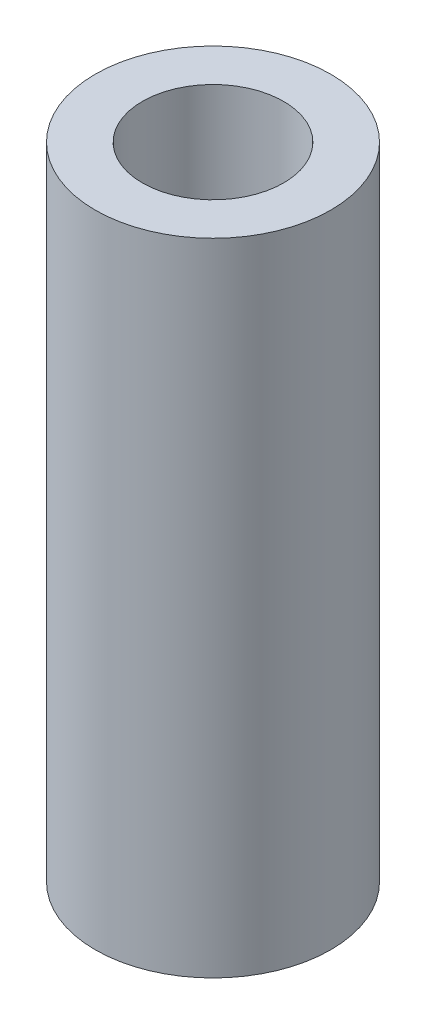
ISO-10303-21;
HEADER;
FILE_DESCRIPTION(('STEP AP214'),'2;1');
FILE_NAME('part.step','',(''),(''),'','','');
FILE_SCHEMA(('AUTOMOTIVE_DESIGN { 1 0 10303 214 1 1 1 1 }'));
ENDSEC;
DATA;
#1=APPLICATION_CONTEXT('core data for automotive mechanical design processes');
#2=APPLICATION_PROTOCOL_DEFINITION('international standard','automotive_design',2000,#1);
#3=PRODUCT_CONTEXT('',#1,'mechanical');
#4=PRODUCT('Part','Part','',(#3));
#5=PRODUCT_RELATED_PRODUCT_CATEGORY('part','',(#4));
#6=PRODUCT_DEFINITION_FORMATION('','',#4);
#7=PRODUCT_DEFINITION_CONTEXT('part definition',#1,'design');
#8=PRODUCT_DEFINITION('design','',#6,#7);
#9=PRODUCT_DEFINITION_SHAPE('','',#8);
#10=(LENGTH_UNIT() NAMED_UNIT(*) SI_UNIT(.MILLI.,.METRE.));
#11=(NAMED_UNIT(*) PLANE_ANGLE_UNIT() SI_UNIT($,.RADIAN.));
#12=(NAMED_UNIT(*) SI_UNIT($,.STERADIAN.) SOLID_ANGLE_UNIT());
#13=UNCERTAINTY_MEASURE_WITH_UNIT(LENGTH_MEASURE(1.E-05),#10,'distance_accuracy_value','');
#14=(GEOMETRIC_REPRESENTATION_CONTEXT(3) GLOBAL_UNCERTAINTY_ASSIGNED_CONTEXT((#13)) GLOBAL_UNIT_ASSIGNED_CONTEXT((#10,
#11,#12)) REPRESENTATION_CONTEXT('',''));
#15=CARTESIAN_POINT('',(0.,0.,0.));
#16=DIRECTION('',(0.,0.,1.));
#17=DIRECTION('',(1.,0.,0.));
#18=AXIS2_PLACEMENT_3D('',#15,#16,#17);
#19=CARTESIAN_POINT('',(0.,34.544,0.));
#20=DIRECTION('',(0.,1.,0.));
#21=DIRECTION('',(0.,0.,1.));
#22=AXIS2_PLACEMENT_3D('',#19,#20,#21);
#23=PLANE('',#22);
#24=CARTESIAN_POINT('',(0.,34.544,0.));
#25=DIRECTION('',(0.,1.,0.));
#26=DIRECTION('',(0.,0.,1.));
#27=AXIS2_PLACEMENT_3D('',#24,#25,#26);
#28=CIRCLE('',#27,6.35);
#29=CARTESIAN_POINT('',(0.,34.544,6.35));
#30=VERTEX_POINT('',#29);
#31=EDGE_CURVE('E10',#30,#30,#28,.T.);
#32=ORIENTED_EDGE('',*,*,#31,.T.);
#33=EDGE_LOOP('',(#32));
#34=FACE_BOUND('',#33,.T.);
#35=CARTESIAN_POINT('',(0.,34.544,0.));
#36=DIRECTION('',(0.,1.,0.));
#37=DIRECTION('',(0.,0.,1.));
#38=AXIS2_PLACEMENT_3D('',#35,#36,#37);
#39=CIRCLE('',#38,3.81);
#40=CARTESIAN_POINT('',(0.,34.544,3.81));
#41=VERTEX_POINT('',#40);
#42=EDGE_CURVE('E56',#41,#41,#39,.T.);
#43=ORIENTED_EDGE('',*,*,#42,.F.);
#44=EDGE_LOOP('',(#43));
#45=FACE_BOUND('',#44,.T.);
#46=ADVANCED_FACE('F43',(#34,#45),#23,.T.);
#47=CARTESIAN_POINT('',(0.,0.,0.));
#48=DIRECTION('',(0.,1.,0.));
#49=DIRECTION('',(0.,0.,1.));
#50=AXIS2_PLACEMENT_3D('',#47,#48,#49);
#51=PLANE('',#50);
#52=CARTESIAN_POINT('',(0.,0.,0.));
#53=DIRECTION('',(0.,1.,0.));
#54=DIRECTION('',(0.,0.,1.));
#55=AXIS2_PLACEMENT_3D('',#52,#53,#54);
#56=CIRCLE('',#55,6.35);
#57=CARTESIAN_POINT('',(0.,0.,6.35));
#58=VERTEX_POINT('',#57);
#59=EDGE_CURVE('E47',#58,#58,#56,.T.);
#60=ORIENTED_EDGE('',*,*,#59,.F.);
#61=EDGE_LOOP('',(#60));
#62=FACE_BOUND('',#61,.T.);
#63=CARTESIAN_POINT('',(0.,0.,0.));
#64=DIRECTION('',(0.,1.,0.));
#65=DIRECTION('',(0.,0.,1.));
#66=AXIS2_PLACEMENT_3D('',#63,#64,#65);
#67=CIRCLE('',#66,3.81);
#68=CARTESIAN_POINT('',(0.,0.,3.81));
#69=VERTEX_POINT('',#68);
#70=EDGE_CURVE('E58',#69,#69,#67,.T.);
#71=ORIENTED_EDGE('',*,*,#70,.T.);
#72=EDGE_LOOP('',(#71));
#73=FACE_BOUND('',#72,.T.);
#74=ADVANCED_FACE('F70',(#62,#73),#51,.F.);
#75=CARTESIAN_POINT('',(0.,34.544,0.));
#76=DIRECTION('',(0.,-1.,0.));
#77=DIRECTION('',(0.,0.,-1.));
#78=AXIS2_PLACEMENT_3D('',#75,#76,#77);
#79=CYLINDRICAL_SURFACE('',#78,6.35);
#80=ORIENTED_EDGE('',*,*,#31,.F.);
#81=EDGE_LOOP('',(#80));
#82=FACE_BOUND('',#81,.T.);
#83=ORIENTED_EDGE('',*,*,#59,.T.);
#84=EDGE_LOOP('',(#83));
#85=FACE_BOUND('',#84,.T.);
#86=ADVANCED_FACE('F45',(#82,#85),#79,.T.);
#87=CARTESIAN_POINT('',(0.,34.544,0.));
#88=DIRECTION('',(0.,-1.,0.));
#89=DIRECTION('',(0.,0.,-1.));
#90=AXIS2_PLACEMENT_3D('',#87,#88,#89);
#91=CYLINDRICAL_SURFACE('',#90,3.81);
#92=ORIENTED_EDGE('',*,*,#42,.T.);
#93=EDGE_LOOP('',(#92));
#94=FACE_BOUND('',#93,.T.);
#95=ORIENTED_EDGE('',*,*,#70,.F.);
#96=EDGE_LOOP('',(#95));
#97=FACE_BOUND('',#96,.T.);
#98=ADVANCED_FACE('F66',(#94,#97),#91,.F.);
#99=CLOSED_SHELL('',(#46,#74,#86,#98));
#100=MANIFOLD_SOLID_BREP('B2',#99);
#101=ADVANCED_BREP_SHAPE_REPRESENTATION('',(#18,#100),#14);
#102=SHAPE_DEFINITION_REPRESENTATION(#9,#101);
ENDSEC;
END-ISO-10303-21;
